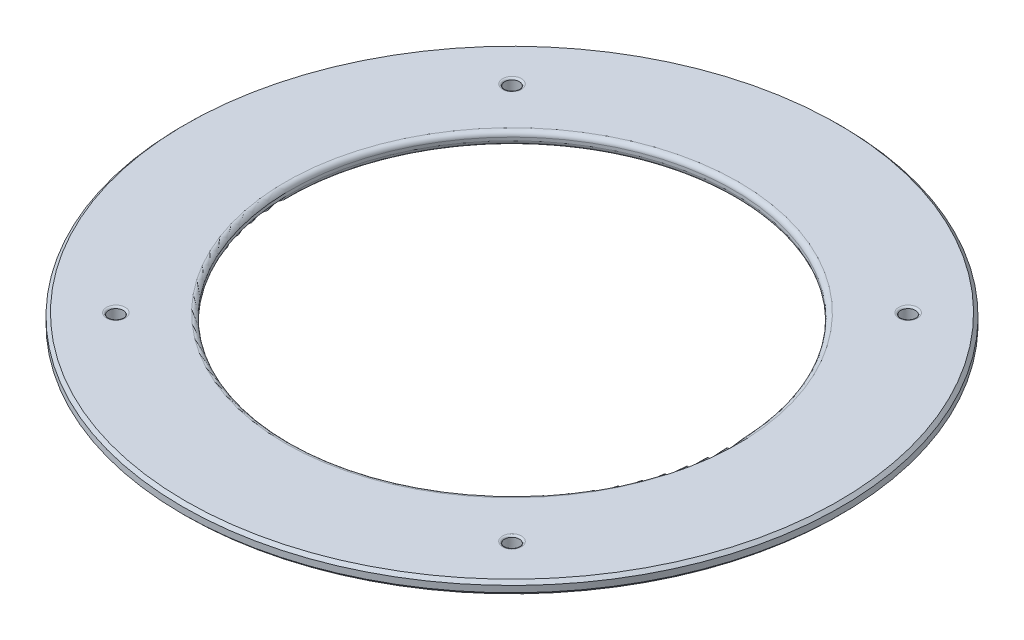
ISO-10303-21;
HEADER;
FILE_DESCRIPTION(('STEP AP214'),'2;1');
FILE_NAME('part.step','',(''),(''),'','','');
FILE_SCHEMA(('AUTOMOTIVE_DESIGN { 1 0 10303 214 1 1 1 1 }'));
ENDSEC;
DATA;
#1=APPLICATION_CONTEXT('core data for automotive mechanical design processes');
#2=APPLICATION_PROTOCOL_DEFINITION('international standard','automotive_design',2000,#1);
#3=PRODUCT_CONTEXT('',#1,'mechanical');
#4=PRODUCT('Part','Part','',(#3));
#5=PRODUCT_RELATED_PRODUCT_CATEGORY('part','',(#4));
#6=PRODUCT_DEFINITION_FORMATION('','',#4);
#7=PRODUCT_DEFINITION_CONTEXT('part definition',#1,'design');
#8=PRODUCT_DEFINITION('design','',#6,#7);
#9=PRODUCT_DEFINITION_SHAPE('','',#8);
#10=(LENGTH_UNIT() NAMED_UNIT(*) SI_UNIT(.MILLI.,.METRE.));
#11=(NAMED_UNIT(*) PLANE_ANGLE_UNIT() SI_UNIT($,.RADIAN.));
#12=(NAMED_UNIT(*) SI_UNIT($,.STERADIAN.) SOLID_ANGLE_UNIT());
#13=UNCERTAINTY_MEASURE_WITH_UNIT(LENGTH_MEASURE(1.E-05),#10,'distance_accuracy_value','');
#14=(GEOMETRIC_REPRESENTATION_CONTEXT(3) GLOBAL_UNCERTAINTY_ASSIGNED_CONTEXT((#13)) GLOBAL_UNIT_ASSIGNED_CONTEXT((#10,
#11,#12)) REPRESENTATION_CONTEXT('',''));
#15=CARTESIAN_POINT('',(0.,0.,0.));
#16=DIRECTION('',(0.,0.,1.));
#17=DIRECTION('',(1.,0.,0.));
#18=AXIS2_PLACEMENT_3D('',#15,#16,#17);
#19=CARTESIAN_POINT('',(0.,4.,0.));
#20=DIRECTION('',(0.,-1.,0.));
#21=DIRECTION('',(0.,0.,-1.));
#22=AXIS2_PLACEMENT_3D('',#19,#20,#21);
#23=CYLINDRICAL_SURFACE('',#22,104.);
#24=CARTESIAN_POINT('',(0.,1.00000000000003,0.));
#25=DIRECTION('',(0.,1.,0.));
#26=DIRECTION('',(0.,0.,1.));
#27=AXIS2_PLACEMENT_3D('',#24,#25,#26);
#28=CIRCLE('',#27,104.);
#29=CARTESIAN_POINT('',(0.,1.00000000000003,104.));
#30=VERTEX_POINT('',#29);
#31=EDGE_CURVE('E71',#30,#30,#28,.T.);
#32=ORIENTED_EDGE('',*,*,#31,.T.);
#33=EDGE_LOOP('',(#32));
#34=FACE_BOUND('',#33,.T.);
#35=CARTESIAN_POINT('',(0.,3.00000000000001,0.));
#36=DIRECTION('',(0.,1.,0.));
#37=DIRECTION('',(0.,0.,1.));
#38=AXIS2_PLACEMENT_3D('',#35,#36,#37);
#39=CIRCLE('',#38,104.);
#40=CARTESIAN_POINT('',(0.,3.00000000000001,104.));
#41=VERTEX_POINT('',#40);
#42=EDGE_CURVE('E74',#41,#41,#39,.F.);
#43=ORIENTED_EDGE('',*,*,#42,.T.);
#44=EDGE_LOOP('',(#43));
#45=FACE_BOUND('',#44,.T.);
#46=ADVANCED_FACE('F45',(#34,#45),#23,.T.);
#47=CARTESIAN_POINT('',(0.,4.,0.));
#48=DIRECTION('',(0.,1.,0.));
#49=DIRECTION('',(0.,0.,1.));
#50=AXIS2_PLACEMENT_3D('',#47,#48,#49);
#51=PLANE('',#50);
#52=CARTESIAN_POINT('',(-62.5,4.,62.5));
#53=DIRECTION('',(0.,1.,0.));
#54=DIRECTION('',(0.,0.,1.));
#55=AXIS2_PLACEMENT_3D('',#52,#53,#54);
#56=CIRCLE('',#55,2.97082039324993);
#57=CARTESIAN_POINT('',(-62.5,4.,65.4708203932499));
#58=VERTEX_POINT('',#57);
#59=EDGE_CURVE('E10',#58,#58,#56,.F.);
#60=ORIENTED_EDGE('',*,*,#59,.T.);
#61=EDGE_LOOP('',(#60));
#62=FACE_BOUND('',#61,.T.);
#63=CARTESIAN_POINT('',(62.5,4.,62.5));
#64=DIRECTION('',(0.,1.,0.));
#65=DIRECTION('',(0.,0.,1.));
#66=AXIS2_PLACEMENT_3D('',#63,#64,#65);
#67=CIRCLE('',#66,2.97082039324992);
#68=CARTESIAN_POINT('',(62.5,4.,65.4708203932499));
#69=VERTEX_POINT('',#68);
#70=EDGE_CURVE('E52',#69,#69,#67,.F.);
#71=ORIENTED_EDGE('',*,*,#70,.T.);
#72=EDGE_LOOP('',(#71));
#73=FACE_BOUND('',#72,.T.);
#74=CARTESIAN_POINT('',(62.5,4.,-62.5));
#75=DIRECTION('',(0.,1.,0.));
#76=DIRECTION('',(0.,0.,1.));
#77=AXIS2_PLACEMENT_3D('',#74,#75,#76);
#78=CIRCLE('',#77,2.97082039324992);
#79=CARTESIAN_POINT('',(62.5,4.,-59.5291796067501));
#80=VERTEX_POINT('',#79);
#81=EDGE_CURVE('E56',#80,#80,#78,.F.);
#82=ORIENTED_EDGE('',*,*,#81,.T.);
#83=EDGE_LOOP('',(#82));
#84=FACE_BOUND('',#83,.T.);
#85=CARTESIAN_POINT('',(-62.5,4.,-62.5));
#86=DIRECTION('',(0.,1.,0.));
#87=DIRECTION('',(0.,0.,1.));
#88=AXIS2_PLACEMENT_3D('',#85,#86,#87);
#89=CIRCLE('',#88,2.97082039324993);
#90=CARTESIAN_POINT('',(-62.5,4.,-59.5291796067501));
#91=VERTEX_POINT('',#90);
#92=EDGE_CURVE('E60',#91,#91,#89,.F.);
#93=ORIENTED_EDGE('',*,*,#92,.T.);
#94=EDGE_LOOP('',(#93));
#95=FACE_BOUND('',#94,.T.);
#96=CARTESIAN_POINT('',(0.,4.,0.));
#97=DIRECTION('',(0.,1.,0.));
#98=DIRECTION('',(0.,0.,1.));
#99=AXIS2_PLACEMENT_3D('',#96,#97,#98);
#100=CIRCLE('',#99,103.);
#101=CARTESIAN_POINT('',(0.,4.,103.));
#102=VERTEX_POINT('',#101);
#103=EDGE_CURVE('E65',#102,#102,#100,.T.);
#104=ORIENTED_EDGE('',*,*,#103,.T.);
#105=EDGE_LOOP('',(#104));
#106=FACE_BOUND('',#105,.T.);
#107=CARTESIAN_POINT('',(0.,4.,0.));
#108=DIRECTION('',(0.,1.,0.));
#109=DIRECTION('',(0.,0.,1.));
#110=AXIS2_PLACEMENT_3D('',#107,#108,#109);
#111=CIRCLE('',#110,71.5);
#112=CARTESIAN_POINT('',(0.,4.,71.5000000000001));
#113=VERTEX_POINT('',#112);
#114=EDGE_CURVE('E96',#113,#113,#111,.F.);
#115=ORIENTED_EDGE('',*,*,#114,.T.);
#116=EDGE_LOOP('',(#115));
#117=FACE_BOUND('',#116,.T.);
#118=ADVANCED_FACE('F140',(#62,#73,#84,#95,#106,#117),#51,.T.);
#119=CARTESIAN_POINT('',(0.,0.,0.));
#120=DIRECTION('',(0.,1.,0.));
#121=DIRECTION('',(0.,0.,1.));
#122=AXIS2_PLACEMENT_3D('',#119,#120,#121);
#123=PLANE('',#122);
#124=CARTESIAN_POINT('',(0.,0.,0.));
#125=DIRECTION('',(0.,1.,0.));
#126=DIRECTION('',(0.,0.,1.));
#127=AXIS2_PLACEMENT_3D('',#124,#125,#126);
#128=CIRCLE('',#127,103.);
#129=CARTESIAN_POINT('',(0.,0.,103.));
#130=VERTEX_POINT('',#129);
#131=EDGE_CURVE('E68',#130,#130,#128,.F.);
#132=ORIENTED_EDGE('',*,*,#131,.T.);
#133=EDGE_LOOP('',(#132));
#134=FACE_BOUND('',#133,.T.);
#135=CARTESIAN_POINT('',(62.5,0.,62.5));
#136=DIRECTION('',(0.,-1.,0.));
#137=DIRECTION('',(0.,0.,-1.));
#138=AXIS2_PLACEMENT_3D('',#135,#136,#137);
#139=CIRCLE('',#138,2.84999999999999);
#140=CARTESIAN_POINT('',(62.5,0.,59.65));
#141=VERTEX_POINT('',#140);
#142=EDGE_CURVE('E114',#141,#141,#139,.T.);
#143=ORIENTED_EDGE('',*,*,#142,.F.);
#144=EDGE_LOOP('',(#143));
#145=FACE_BOUND('',#144,.T.);
#146=CARTESIAN_POINT('',(62.5,0.,-62.5));
#147=DIRECTION('',(0.,-1.,0.));
#148=DIRECTION('',(0.,0.,-1.));
#149=AXIS2_PLACEMENT_3D('',#146,#147,#148);
#150=CIRCLE('',#149,2.84999999999999);
#151=CARTESIAN_POINT('',(62.5,0.,-65.35));
#152=VERTEX_POINT('',#151);
#153=EDGE_CURVE('E120',#152,#152,#150,.T.);
#154=ORIENTED_EDGE('',*,*,#153,.F.);
#155=EDGE_LOOP('',(#154));
#156=FACE_BOUND('',#155,.T.);
#157=CARTESIAN_POINT('',(-62.5,0.,-62.5));
#158=DIRECTION('',(0.,-1.,0.));
#159=DIRECTION('',(0.,0.,-1.));
#160=AXIS2_PLACEMENT_3D('',#157,#158,#159);
#161=CIRCLE('',#160,2.84999999999999);
#162=CARTESIAN_POINT('',(-62.5,0.,-65.35));
#163=VERTEX_POINT('',#162);
#164=EDGE_CURVE('E108',#163,#163,#161,.T.);
#165=ORIENTED_EDGE('',*,*,#164,.F.);
#166=EDGE_LOOP('',(#165));
#167=FACE_BOUND('',#166,.T.);
#168=CARTESIAN_POINT('',(-62.5,0.,62.5));
#169=DIRECTION('',(0.,-1.,0.));
#170=DIRECTION('',(0.,0.,-1.));
#171=AXIS2_PLACEMENT_3D('',#168,#169,#170);
#172=CIRCLE('',#171,2.84999999999999);
#173=CARTESIAN_POINT('',(-62.5,0.,59.65));
#174=VERTEX_POINT('',#173);
#175=EDGE_CURVE('E81',#174,#174,#172,.T.);
#176=ORIENTED_EDGE('',*,*,#175,.F.);
#177=EDGE_LOOP('',(#176));
#178=FACE_BOUND('',#177,.T.);
#179=CARTESIAN_POINT('',(0.,0.,0.));
#180=DIRECTION('',(0.,1.,0.));
#181=DIRECTION('',(0.,0.,1.));
#182=AXIS2_PLACEMENT_3D('',#179,#180,#181);
#183=CIRCLE('',#182,71.5);
#184=CARTESIAN_POINT('',(0.,0.,71.5000000000001));
#185=VERTEX_POINT('',#184);
#186=EDGE_CURVE('E77',#185,#185,#183,.T.);
#187=ORIENTED_EDGE('',*,*,#186,.T.);
#188=EDGE_LOOP('',(#187));
#189=FACE_BOUND('',#188,.T.);
#190=ADVANCED_FACE('F136',(#134,#145,#156,#167,#178,#189),#123,.F.);
#191=CARTESIAN_POINT('',(0.,0.,0.));
#192=DIRECTION('',(0.,1.,0.));
#193=DIRECTION('',(0.,0.,1.));
#194=AXIS2_PLACEMENT_3D('',#191,#192,#193);
#195=CYLINDRICAL_SURFACE('',#194,70.);
#196=CARTESIAN_POINT('',(0.,2.5,0.));
#197=DIRECTION('',(0.,1.,0.));
#198=DIRECTION('',(0.,0.,1.));
#199=AXIS2_PLACEMENT_3D('',#196,#197,#198);
#200=CIRCLE('',#199,70.);
#201=CARTESIAN_POINT('',(0.,2.5,70.0000000000001));
#202=VERTEX_POINT('',#201);
#203=EDGE_CURVE('E99',#202,#202,#200,.T.);
#204=ORIENTED_EDGE('',*,*,#203,.T.);
#205=EDGE_LOOP('',(#204));
#206=FACE_BOUND('',#205,.T.);
#207=CARTESIAN_POINT('',(0.,1.5,0.));
#208=DIRECTION('',(0.,1.,0.));
#209=DIRECTION('',(0.,0.,1.));
#210=AXIS2_PLACEMENT_3D('',#207,#208,#209);
#211=CIRCLE('',#210,70.);
#212=CARTESIAN_POINT('',(0.,1.5,70.0000000000001));
#213=VERTEX_POINT('',#212);
#214=EDGE_CURVE('E92',#213,#213,#211,.F.);
#215=ORIENTED_EDGE('',*,*,#214,.T.);
#216=EDGE_LOOP('',(#215));
#217=FACE_BOUND('',#216,.T.);
#218=ADVANCED_FACE('F139',(#206,#217),#195,.F.);
#219=CARTESIAN_POINT('',(0.,2.5,0.));
#220=DIRECTION('',(0.,1.,0.));
#221=DIRECTION('',(0.,0.,1.));
#222=AXIS2_PLACEMENT_3D('',#219,#220,#221);
#223=TOROIDAL_SURFACE('',#222,71.5,1.5);
#224=ORIENTED_EDGE('',*,*,#114,.F.);
#225=EDGE_LOOP('',(#224));
#226=FACE_BOUND('',#225,.T.);
#227=ORIENTED_EDGE('',*,*,#203,.F.);
#228=EDGE_LOOP('',(#227));
#229=FACE_BOUND('',#228,.T.);
#230=ADVANCED_FACE('F152',(#226,#229),#223,.T.);
#231=CARTESIAN_POINT('',(0.,1.5,0.));
#232=DIRECTION('',(0.,1.,0.));
#233=DIRECTION('',(0.,0.,1.));
#234=AXIS2_PLACEMENT_3D('',#231,#232,#233);
#235=TOROIDAL_SURFACE('',#234,71.5,1.5);
#236=ORIENTED_EDGE('',*,*,#214,.F.);
#237=EDGE_LOOP('',(#236));
#238=FACE_BOUND('',#237,.T.);
#239=ORIENTED_EDGE('',*,*,#186,.F.);
#240=EDGE_LOOP('',(#239));
#241=FACE_BOUND('',#240,.T.);
#242=ADVANCED_FACE('F149',(#238,#241),#235,.T.);
#243=CARTESIAN_POINT('',(-62.5,3.5,62.5));
#244=DIRECTION('',(0.,-1.,0.));
#245=DIRECTION('',(0.,0.,-1.));
#246=AXIS2_PLACEMENT_3D('',#243,#244,#245);
#247=PLANE('',#246);
#248=CARTESIAN_POINT('',(-62.5,3.5,62.5));
#249=DIRECTION('',(0.,-1.,0.));
#250=DIRECTION('',(0.,0.,-1.));
#251=AXIS2_PLACEMENT_3D('',#248,#249,#250);
#252=CIRCLE('',#251,2.84999999999999);
#253=CARTESIAN_POINT('',(-62.5,3.5,59.65));
#254=VERTEX_POINT('',#253);
#255=EDGE_CURVE('E93',#254,#254,#252,.T.);
#256=ORIENTED_EDGE('',*,*,#255,.T.);
#257=EDGE_LOOP('',(#256));
#258=FACE_BOUND('',#257,.T.);
#259=CARTESIAN_POINT('',(-62.5,3.5,62.5));
#260=DIRECTION('',(0.,-1.,0.));
#261=DIRECTION('',(0.,0.,-1.));
#262=AXIS2_PLACEMENT_3D('',#259,#260,#261);
#263=CIRCLE('',#262,2.29999999999999);
#264=CARTESIAN_POINT('',(-62.5,3.5,60.2));
#265=VERTEX_POINT('',#264);
#266=EDGE_CURVE('E89',#265,#265,#263,.F.);
#267=ORIENTED_EDGE('',*,*,#266,.T.);
#268=EDGE_LOOP('',(#267));
#269=FACE_BOUND('',#268,.T.);
#270=ADVANCED_FACE('F151',(#258,#269),#247,.T.);
#271=CARTESIAN_POINT('',(-62.5,3.5,62.5));
#272=DIRECTION('',(0.,-1.,0.));
#273=DIRECTION('',(0.,0.,-1.));
#274=AXIS2_PLACEMENT_3D('',#271,#272,#273);
#275=CYLINDRICAL_SURFACE('',#274,2.84999999999999);
#276=ORIENTED_EDGE('',*,*,#255,.F.);
#277=EDGE_LOOP('',(#276));
#278=FACE_BOUND('',#277,.T.);
#279=ORIENTED_EDGE('',*,*,#175,.T.);
#280=EDGE_LOOP('',(#279));
#281=FACE_BOUND('',#280,.T.);
#282=ADVANCED_FACE('F159',(#278,#281),#275,.F.);
#283=CARTESIAN_POINT('',(-62.5,3.5,-62.5));
#284=DIRECTION('',(0.,-1.,0.));
#285=DIRECTION('',(0.,0.,-1.));
#286=AXIS2_PLACEMENT_3D('',#283,#284,#285);
#287=PLANE('',#286);
#288=CARTESIAN_POINT('',(-62.5,3.5,-62.5));
#289=DIRECTION('',(0.,-1.,0.));
#290=DIRECTION('',(0.,0.,-1.));
#291=AXIS2_PLACEMENT_3D('',#288,#289,#290);
#292=CIRCLE('',#291,2.84999999999999);
#293=CARTESIAN_POINT('',(-62.5,3.5,-65.35));
#294=VERTEX_POINT('',#293);
#295=EDGE_CURVE('E88',#294,#294,#292,.T.);
#296=ORIENTED_EDGE('',*,*,#295,.T.);
#297=EDGE_LOOP('',(#296));
#298=FACE_BOUND('',#297,.T.);
#299=CARTESIAN_POINT('',(-62.5,3.5,-62.5));
#300=DIRECTION('',(0.,-1.,0.));
#301=DIRECTION('',(0.,0.,-1.));
#302=AXIS2_PLACEMENT_3D('',#299,#300,#301);
#303=CIRCLE('',#302,2.29999999999999);
#304=CARTESIAN_POINT('',(-62.5,3.5,-64.8));
#305=VERTEX_POINT('',#304);
#306=EDGE_CURVE('E85',#305,#305,#303,.F.);
#307=ORIENTED_EDGE('',*,*,#306,.T.);
#308=EDGE_LOOP('',(#307));
#309=FACE_BOUND('',#308,.T.);
#310=ADVANCED_FACE('F180',(#298,#309),#287,.T.);
#311=CARTESIAN_POINT('',(-62.5,3.5,-62.5));
#312=DIRECTION('',(0.,-1.,0.));
#313=DIRECTION('',(0.,0.,-1.));
#314=AXIS2_PLACEMENT_3D('',#311,#312,#313);
#315=CYLINDRICAL_SURFACE('',#314,2.84999999999999);
#316=ORIENTED_EDGE('',*,*,#295,.F.);
#317=EDGE_LOOP('',(#316));
#318=FACE_BOUND('',#317,.T.);
#319=ORIENTED_EDGE('',*,*,#164,.T.);
#320=EDGE_LOOP('',(#319));
#321=FACE_BOUND('',#320,.T.);
#322=ADVANCED_FACE('F183',(#318,#321),#315,.F.);
#323=CARTESIAN_POINT('',(62.5,3.5,-62.5));
#324=DIRECTION('',(0.,-1.,0.));
#325=DIRECTION('',(0.,0.,-1.));
#326=AXIS2_PLACEMENT_3D('',#323,#324,#325);
#327=PLANE('',#326);
#328=CARTESIAN_POINT('',(62.5,3.5,-62.5));
#329=DIRECTION('',(0.,-1.,0.));
#330=DIRECTION('',(0.,0.,-1.));
#331=AXIS2_PLACEMENT_3D('',#328,#329,#330);
#332=CIRCLE('',#331,2.84999999999999);
#333=CARTESIAN_POINT('',(62.5,3.5,-65.35));
#334=VERTEX_POINT('',#333);
#335=EDGE_CURVE('E111',#334,#334,#332,.T.);
#336=ORIENTED_EDGE('',*,*,#335,.T.);
#337=EDGE_LOOP('',(#336));
#338=FACE_BOUND('',#337,.T.);
#339=CARTESIAN_POINT('',(62.5,3.5,-62.5));
#340=DIRECTION('',(0.,-1.,0.));
#341=DIRECTION('',(0.,0.,-1.));
#342=AXIS2_PLACEMENT_3D('',#339,#340,#341);
#343=CIRCLE('',#342,2.29999999999998);
#344=CARTESIAN_POINT('',(62.5,3.5,-64.8));
#345=VERTEX_POINT('',#344);
#346=EDGE_CURVE('E82',#345,#345,#343,.F.);
#347=ORIENTED_EDGE('',*,*,#346,.T.);
#348=EDGE_LOOP('',(#347));
#349=FACE_BOUND('',#348,.T.);
#350=ADVANCED_FACE('F126',(#338,#349),#327,.T.);
#351=CARTESIAN_POINT('',(62.5,3.5,-62.5));
#352=DIRECTION('',(0.,-1.,0.));
#353=DIRECTION('',(0.,0.,-1.));
#354=AXIS2_PLACEMENT_3D('',#351,#352,#353);
#355=CYLINDRICAL_SURFACE('',#354,2.84999999999999);
#356=ORIENTED_EDGE('',*,*,#335,.F.);
#357=EDGE_LOOP('',(#356));
#358=FACE_BOUND('',#357,.T.);
#359=ORIENTED_EDGE('',*,*,#153,.T.);
#360=EDGE_LOOP('',(#359));
#361=FACE_BOUND('',#360,.T.);
#362=ADVANCED_FACE('F129',(#358,#361),#355,.F.);
#363=CARTESIAN_POINT('',(62.5,3.5,62.5));
#364=DIRECTION('',(0.,-1.,0.));
#365=DIRECTION('',(0.,0.,-1.));
#366=AXIS2_PLACEMENT_3D('',#363,#364,#365);
#367=PLANE('',#366);
#368=CARTESIAN_POINT('',(62.5,3.5,62.5));
#369=DIRECTION('',(0.,-1.,0.));
#370=DIRECTION('',(0.,0.,-1.));
#371=AXIS2_PLACEMENT_3D('',#368,#369,#370);
#372=CIRCLE('',#371,2.84999999999999);
#373=CARTESIAN_POINT('',(62.5,3.5,59.65));
#374=VERTEX_POINT('',#373);
#375=EDGE_CURVE('E117',#374,#374,#372,.T.);
#376=ORIENTED_EDGE('',*,*,#375,.T.);
#377=EDGE_LOOP('',(#376));
#378=FACE_BOUND('',#377,.T.);
#379=CARTESIAN_POINT('',(62.5,3.5,62.5));
#380=DIRECTION('',(0.,-1.,0.));
#381=DIRECTION('',(0.,0.,-1.));
#382=AXIS2_PLACEMENT_3D('',#379,#380,#381);
#383=CIRCLE('',#382,2.29999999999998);
#384=CARTESIAN_POINT('',(62.5,3.5,60.2));
#385=VERTEX_POINT('',#384);
#386=EDGE_CURVE('E78',#385,#385,#383,.F.);
#387=ORIENTED_EDGE('',*,*,#386,.T.);
#388=EDGE_LOOP('',(#387));
#389=FACE_BOUND('',#388,.T.);
#390=ADVANCED_FACE('F132',(#378,#389),#367,.T.);
#391=CARTESIAN_POINT('',(62.5,3.5,62.5));
#392=DIRECTION('',(0.,-1.,0.));
#393=DIRECTION('',(0.,0.,-1.));
#394=AXIS2_PLACEMENT_3D('',#391,#392,#393);
#395=CYLINDRICAL_SURFACE('',#394,2.84999999999999);
#396=ORIENTED_EDGE('',*,*,#375,.F.);
#397=EDGE_LOOP('',(#396));
#398=FACE_BOUND('',#397,.T.);
#399=ORIENTED_EDGE('',*,*,#142,.T.);
#400=EDGE_LOOP('',(#399));
#401=FACE_BOUND('',#400,.T.);
#402=ADVANCED_FACE('F190',(#398,#401),#395,.F.);
#403=CARTESIAN_POINT('',(0.,1.00000000000003,0.));
#404=DIRECTION('',(0.,1.,0.));
#405=DIRECTION('',(0.,0.,1.));
#406=AXIS2_PLACEMENT_3D('',#403,#404,#405);
#407=CONICAL_SURFACE('',#406,104.,0.785398163397448);
#408=ORIENTED_EDGE('',*,*,#131,.F.);
#409=EDGE_LOOP('',(#408));
#410=FACE_BOUND('',#409,.T.);
#411=ORIENTED_EDGE('',*,*,#31,.F.);
#412=EDGE_LOOP('',(#411));
#413=FACE_BOUND('',#412,.T.);
#414=ADVANCED_FACE('F192',(#410,#413),#407,.T.);
#415=CARTESIAN_POINT('',(0.,4.,0.));
#416=DIRECTION('',(0.,-1.,0.));
#417=DIRECTION('',(0.,0.,-1.));
#418=AXIS2_PLACEMENT_3D('',#415,#416,#417);
#419=CONICAL_SURFACE('',#418,103.,0.785398163397455);
#420=ORIENTED_EDGE('',*,*,#42,.F.);
#421=EDGE_LOOP('',(#420));
#422=FACE_BOUND('',#421,.T.);
#423=ORIENTED_EDGE('',*,*,#103,.F.);
#424=EDGE_LOOP('',(#423));
#425=FACE_BOUND('',#424,.T.);
#426=ADVANCED_FACE('F227',(#422,#425),#419,.T.);
#427=CARTESIAN_POINT('',(-62.5,3.3,-62.5));
#428=DIRECTION('',(0.,1.,0.));
#429=DIRECTION('',(0.,0.,1.));
#430=AXIS2_PLACEMENT_3D('',#427,#428,#429);
#431=TOROIDAL_SURFACE('',#430,2.97082039324993,0.7);
#432=ORIENTED_EDGE('',*,*,#92,.F.);
#433=EDGE_LOOP('',(#432));
#434=FACE_BOUND('',#433,.T.);
#435=ORIENTED_EDGE('',*,*,#306,.F.);
#436=EDGE_LOOP('',(#435));
#437=FACE_BOUND('',#436,.T.);
#438=ADVANCED_FACE('F236',(#434,#437),#431,.T.);
#439=CARTESIAN_POINT('',(62.5,3.3,-62.5));
#440=DIRECTION('',(0.,1.,0.));
#441=DIRECTION('',(0.,0.,1.));
#442=AXIS2_PLACEMENT_3D('',#439,#440,#441);
#443=TOROIDAL_SURFACE('',#442,2.97082039324992,0.7);
#444=ORIENTED_EDGE('',*,*,#81,.F.);
#445=EDGE_LOOP('',(#444));
#446=FACE_BOUND('',#445,.T.);
#447=ORIENTED_EDGE('',*,*,#346,.F.);
#448=EDGE_LOOP('',(#447));
#449=FACE_BOUND('',#448,.T.);
#450=ADVANCED_FACE('F246',(#446,#449),#443,.T.);
#451=CARTESIAN_POINT('',(62.5,3.3,62.5));
#452=DIRECTION('',(0.,1.,0.));
#453=DIRECTION('',(0.,0.,1.));
#454=AXIS2_PLACEMENT_3D('',#451,#452,#453);
#455=TOROIDAL_SURFACE('',#454,2.97082039324992,0.7);
#456=ORIENTED_EDGE('',*,*,#70,.F.);
#457=EDGE_LOOP('',(#456));
#458=FACE_BOUND('',#457,.T.);
#459=ORIENTED_EDGE('',*,*,#386,.F.);
#460=EDGE_LOOP('',(#459));
#461=FACE_BOUND('',#460,.T.);
#462=ADVANCED_FACE('F256',(#458,#461),#455,.T.);
#463=CARTESIAN_POINT('',(-62.5,3.3,62.5));
#464=DIRECTION('',(0.,1.,0.));
#465=DIRECTION('',(0.,0.,1.));
#466=AXIS2_PLACEMENT_3D('',#463,#464,#465);
#467=TOROIDAL_SURFACE('',#466,2.97082039324993,0.7);
#468=ORIENTED_EDGE('',*,*,#59,.F.);
#469=EDGE_LOOP('',(#468));
#470=FACE_BOUND('',#469,.T.);
#471=ORIENTED_EDGE('',*,*,#266,.F.);
#472=EDGE_LOOP('',(#471));
#473=FACE_BOUND('',#472,.T.);
#474=ADVANCED_FACE('F47',(#470,#473),#467,.T.);
#475=CLOSED_SHELL('',(#46,#118,#190,#218,#230,#242,#270,#282,#310,#322,#350,#362,#390,#402,#414,
#426,#438,#450,#462,#474));
#476=MANIFOLD_SOLID_BREP('B2',#475);
#477=ADVANCED_BREP_SHAPE_REPRESENTATION('',(#18,#476),#14);
#478=SHAPE_DEFINITION_REPRESENTATION(#9,#477);
ENDSEC;
END-ISO-10303-21;
